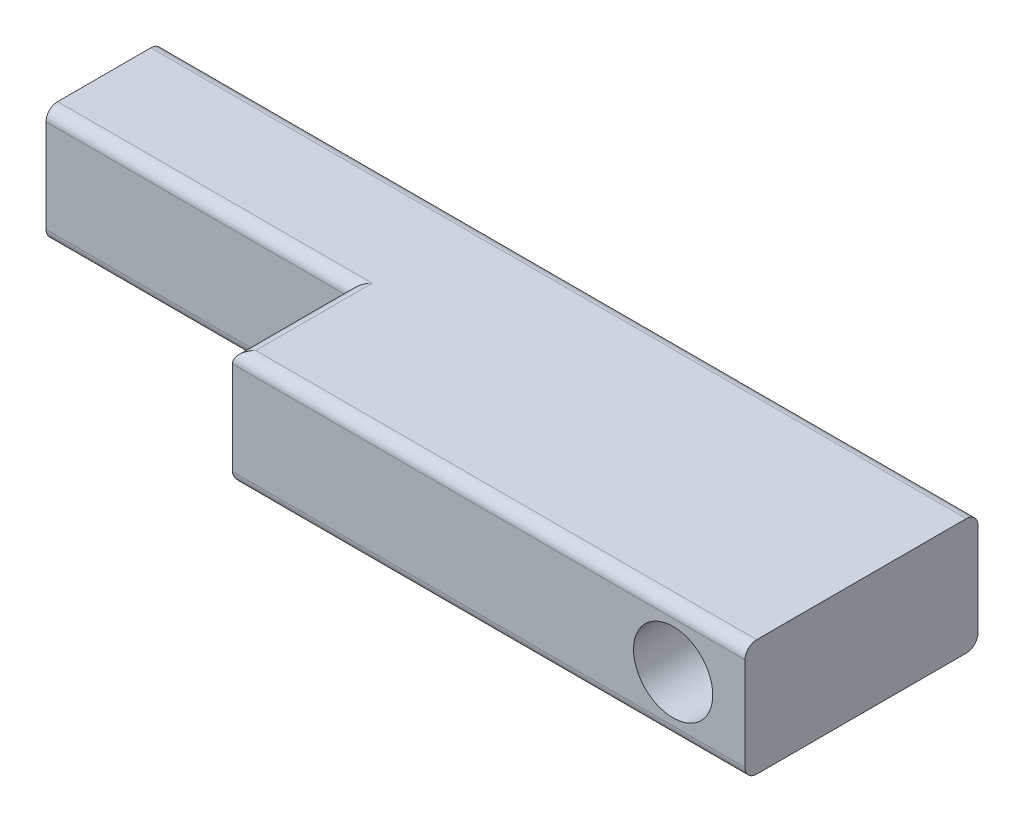
ISO-10303-21;
HEADER;
FILE_DESCRIPTION(('STEP AP214'),'2;1');
FILE_NAME('part.step','',(''),(''),'','','');
FILE_SCHEMA(('AUTOMOTIVE_DESIGN { 1 0 10303 214 1 1 1 1 }'));
ENDSEC;
DATA;
#1=APPLICATION_CONTEXT('core data for automotive mechanical design processes');
#2=APPLICATION_PROTOCOL_DEFINITION('international standard','automotive_design',2000,#1);
#3=PRODUCT_CONTEXT('',#1,'mechanical');
#4=PRODUCT('Part','Part','',(#3));
#5=PRODUCT_RELATED_PRODUCT_CATEGORY('part','',(#4));
#6=PRODUCT_DEFINITION_FORMATION('','',#4);
#7=PRODUCT_DEFINITION_CONTEXT('part definition',#1,'design');
#8=PRODUCT_DEFINITION('design','',#6,#7);
#9=PRODUCT_DEFINITION_SHAPE('','',#8);
#10=(LENGTH_UNIT() NAMED_UNIT(*) SI_UNIT(.MILLI.,.METRE.));
#11=(NAMED_UNIT(*) PLANE_ANGLE_UNIT() SI_UNIT($,.RADIAN.));
#12=(NAMED_UNIT(*) SI_UNIT($,.STERADIAN.) SOLID_ANGLE_UNIT());
#13=UNCERTAINTY_MEASURE_WITH_UNIT(LENGTH_MEASURE(1.E-05),#10,'distance_accuracy_value','');
#14=(GEOMETRIC_REPRESENTATION_CONTEXT(3) GLOBAL_UNCERTAINTY_ASSIGNED_CONTEXT((#13)) GLOBAL_UNIT_ASSIGNED_CONTEXT((#10,
#11,#12)) REPRESENTATION_CONTEXT('',''));
#15=CARTESIAN_POINT('',(0.,0.,0.));
#16=DIRECTION('',(0.,0.,1.));
#17=DIRECTION('',(1.,0.,0.));
#18=AXIS2_PLACEMENT_3D('',#15,#16,#17);
#19=CARTESIAN_POINT('',(0.,0.,5.));
#20=DIRECTION('',(0.,0.,-1.));
#21=DIRECTION('',(-1.,0.,0.));
#22=AXIS2_PLACEMENT_3D('',#19,#20,#21);
#23=PLANE('',#22);
#24=DIRECTION('',(0.,-1.,0.));
#25=VECTOR('',#24,1.);
#26=CARTESIAN_POINT('',(-17.5,-2.5,5.));
#27=LINE('',#26,#25);
#28=CARTESIAN_POINT('',(-17.5,2.,5.));
#29=VERTEX_POINT('',#28);
#30=CARTESIAN_POINT('',(-17.5,-2.,5.));
#31=VERTEX_POINT('',#30);
#32=EDGE_CURVE('E179',#29,#31,#27,.T.);
#33=ORIENTED_EDGE('',*,*,#32,.T.);
#34=DIRECTION('',(1.,0.,0.));
#35=VECTOR('',#34,1.);
#36=CARTESIAN_POINT('',(0.,-2.,5.));
#37=LINE('',#36,#35);
#38=CARTESIAN_POINT('',(-4.5,-2.,5.));
#39=VERTEX_POINT('',#38);
#40=EDGE_CURVE('E152',#31,#39,#37,.T.);
#41=ORIENTED_EDGE('',*,*,#40,.T.);
#42=DIRECTION('',(0.,-1.,0.));
#43=VECTOR('',#42,1.);
#44=CARTESIAN_POINT('',(-4.5,2.5,5.));
#45=LINE('',#44,#43);
#46=CARTESIAN_POINT('',(-4.5,2.,5.));
#47=VERTEX_POINT('',#46);
#48=EDGE_CURVE('E159',#47,#39,#45,.T.);
#49=ORIENTED_EDGE('',*,*,#48,.F.);
#50=DIRECTION('',(-1.,0.,0.));
#51=VECTOR('',#50,1.);
#52=CARTESIAN_POINT('',(0.,2.,5.));
#53=LINE('',#52,#51);
#54=EDGE_CURVE('E144',#47,#29,#53,.T.);
#55=ORIENTED_EDGE('',*,*,#54,.T.);
#56=EDGE_LOOP('',(#33,#41,#49,#55));
#57=FACE_BOUND('',#56,.T.);
#58=ADVANCED_FACE('F39',(#57),#23,.F.);
#59=CARTESIAN_POINT('',(17.5,-2.5,5.));
#60=DIRECTION('',(-1.,0.,0.));
#61=DIRECTION('',(0.,0.,1.));
#62=AXIS2_PLACEMENT_3D('',#59,#60,#61);
#63=PLANE('',#62);
#64=DIRECTION('',(0.,1.,0.));
#65=VECTOR('',#64,1.);
#66=CARTESIAN_POINT('',(17.5,2.5,10.));
#67=LINE('',#66,#65);
#68=CARTESIAN_POINT('',(17.5,-2.,10.));
#69=VERTEX_POINT('',#68);
#70=CARTESIAN_POINT('',(17.5,2.,10.));
#71=VERTEX_POINT('',#70);
#72=EDGE_CURVE('E170',#69,#71,#67,.T.);
#73=ORIENTED_EDGE('',*,*,#72,.F.);
#74=CARTESIAN_POINT('',(17.5,-2.,9.5));
#75=DIRECTION('',(-1.,0.,0.));
#76=DIRECTION('',(0.,0.,1.));
#77=AXIS2_PLACEMENT_3D('',#74,#75,#76);
#78=CIRCLE('',#77,0.5);
#79=CARTESIAN_POINT('',(17.5,-2.5,9.5));
#80=VERTEX_POINT('',#79);
#81=EDGE_CURVE('E257',#69,#80,#78,.F.);
#82=ORIENTED_EDGE('',*,*,#81,.T.);
#83=DIRECTION('',(0.,0.,-1.));
#84=VECTOR('',#83,1.);
#85=CARTESIAN_POINT('',(17.5,-2.5,5.));
#86=LINE('',#85,#84);
#87=CARTESIAN_POINT('',(17.5,-2.5,0.5));
#88=VERTEX_POINT('',#87);
#89=EDGE_CURVE('E182',#80,#88,#86,.T.);
#90=ORIENTED_EDGE('',*,*,#89,.T.);
#91=CARTESIAN_POINT('',(17.5,-2.,0.5));
#92=DIRECTION('',(-1.,0.,0.));
#93=DIRECTION('',(0.,0.,1.));
#94=AXIS2_PLACEMENT_3D('',#91,#92,#93);
#95=CIRCLE('',#94,0.5);
#96=CARTESIAN_POINT('',(17.5,-2.,0.));
#97=VERTEX_POINT('',#96);
#98=EDGE_CURVE('E63',#88,#97,#95,.F.);
#99=ORIENTED_EDGE('',*,*,#98,.T.);
#100=DIRECTION('',(0.,1.,0.));
#101=VECTOR('',#100,1.);
#102=CARTESIAN_POINT('',(17.5,-2.5,0.));
#103=LINE('',#102,#101);
#104=CARTESIAN_POINT('',(17.5,2.,0.));
#105=VERTEX_POINT('',#104);
#106=EDGE_CURVE('E184',#97,#105,#103,.T.);
#107=ORIENTED_EDGE('',*,*,#106,.T.);
#108=CARTESIAN_POINT('',(17.5,2.,0.5));
#109=DIRECTION('',(-1.,0.,0.));
#110=DIRECTION('',(0.,0.,1.));
#111=AXIS2_PLACEMENT_3D('',#108,#109,#110);
#112=CIRCLE('',#111,0.5);
#113=CARTESIAN_POINT('',(17.5,2.5,0.5));
#114=VERTEX_POINT('',#113);
#115=EDGE_CURVE('E249',#105,#114,#112,.F.);
#116=ORIENTED_EDGE('',*,*,#115,.T.);
#117=DIRECTION('',(0.,0.,-1.));
#118=VECTOR('',#117,1.);
#119=CARTESIAN_POINT('',(17.5,2.5,5.));
#120=LINE('',#119,#118);
#121=CARTESIAN_POINT('',(17.5,2.5,9.5));
#122=VERTEX_POINT('',#121);
#123=EDGE_CURVE('E200',#122,#114,#120,.T.);
#124=ORIENTED_EDGE('',*,*,#123,.F.);
#125=CARTESIAN_POINT('',(17.5,2.,9.5));
#126=DIRECTION('',(-1.,0.,0.));
#127=DIRECTION('',(0.,0.,1.));
#128=AXIS2_PLACEMENT_3D('',#125,#126,#127);
#129=CIRCLE('',#128,0.5);
#130=EDGE_CURVE('E254',#122,#71,#129,.F.);
#131=ORIENTED_EDGE('',*,*,#130,.T.);
#132=EDGE_LOOP('',(#73,#82,#90,#99,#107,#116,#124,#131));
#133=FACE_BOUND('',#132,.T.);
#134=ADVANCED_FACE('F308',(#133),#63,.F.);
#135=CARTESIAN_POINT('',(-17.5,2.5,5.));
#136=DIRECTION('',(0.,-1.,0.));
#137=DIRECTION('',(0.,0.,-1.));
#138=AXIS2_PLACEMENT_3D('',#135,#136,#137);
#139=PLANE('',#138);
#140=DIRECTION('',(0.,0.,-1.));
#141=VECTOR('',#140,1.);
#142=CARTESIAN_POINT('',(-17.5,2.5,5.));
#143=LINE('',#142,#141);
#144=CARTESIAN_POINT('',(-17.5,2.5,4.5));
#145=VERTEX_POINT('',#144);
#146=CARTESIAN_POINT('',(-17.5,2.5,0.5));
#147=VERTEX_POINT('',#146);
#148=EDGE_CURVE('E196',#145,#147,#143,.T.);
#149=ORIENTED_EDGE('',*,*,#148,.F.);
#150=DIRECTION('',(-1.,0.,0.));
#151=VECTOR('',#150,1.);
#152=CARTESIAN_POINT('',(-17.5,2.5,4.5));
#153=LINE('',#152,#151);
#154=CARTESIAN_POINT('',(-4.,2.5,4.5));
#155=VERTEX_POINT('',#154);
#156=EDGE_CURVE('E214',#145,#155,#153,.F.);
#157=ORIENTED_EDGE('',*,*,#156,.T.);
#158=DIRECTION('',(0.,0.,-1.));
#159=VECTOR('',#158,1.);
#160=CARTESIAN_POINT('',(-4.,2.5,5.));
#161=LINE('',#160,#159);
#162=CARTESIAN_POINT('',(-4.,2.5,9.5));
#163=VERTEX_POINT('',#162);
#164=EDGE_CURVE('E137',#155,#163,#161,.F.);
#165=ORIENTED_EDGE('',*,*,#164,.T.);
#166=DIRECTION('',(-1.,0.,0.));
#167=VECTOR('',#166,1.);
#168=CARTESIAN_POINT('',(-17.5,2.5,9.5));
#169=LINE('',#168,#167);
#170=EDGE_CURVE('E209',#163,#122,#169,.F.);
#171=ORIENTED_EDGE('',*,*,#170,.T.);
#172=ORIENTED_EDGE('',*,*,#123,.T.);
#173=DIRECTION('',(-1.,0.,0.));
#174=VECTOR('',#173,1.);
#175=CARTESIAN_POINT('',(-17.5,2.5,0.5));
#176=LINE('',#175,#174);
#177=EDGE_CURVE('E165',#114,#147,#176,.T.);
#178=ORIENTED_EDGE('',*,*,#177,.T.);
#179=EDGE_LOOP('',(#149,#157,#165,#171,#172,#178));
#180=FACE_BOUND('',#179,.T.);
#181=ADVANCED_FACE('F303',(#180),#139,.F.);
#182=CARTESIAN_POINT('',(-17.5,-2.5,5.));
#183=DIRECTION('',(1.,0.,0.));
#184=DIRECTION('',(0.,0.,-1.));
#185=AXIS2_PLACEMENT_3D('',#182,#183,#184);
#186=PLANE('',#185);
#187=DIRECTION('',(0.,0.,-1.));
#188=VECTOR('',#187,1.);
#189=CARTESIAN_POINT('',(-17.5,-2.5,5.));
#190=LINE('',#189,#188);
#191=CARTESIAN_POINT('',(-17.5,-2.5,4.5));
#192=VERTEX_POINT('',#191);
#193=CARTESIAN_POINT('',(-17.5,-2.5,0.5));
#194=VERTEX_POINT('',#193);
#195=EDGE_CURVE('E192',#192,#194,#190,.T.);
#196=ORIENTED_EDGE('',*,*,#195,.F.);
#197=CARTESIAN_POINT('',(-17.5,-2.,4.5));
#198=DIRECTION('',(1.,0.,0.));
#199=DIRECTION('',(0.,0.,-1.));
#200=AXIS2_PLACEMENT_3D('',#197,#198,#199);
#201=CIRCLE('',#200,0.5);
#202=EDGE_CURVE('E240',#192,#31,#201,.F.);
#203=ORIENTED_EDGE('',*,*,#202,.T.);
#204=ORIENTED_EDGE('',*,*,#32,.F.);
#205=CARTESIAN_POINT('',(-17.5,2.,4.5));
#206=DIRECTION('',(1.,0.,0.));
#207=DIRECTION('',(0.,0.,-1.));
#208=AXIS2_PLACEMENT_3D('',#205,#206,#207);
#209=CIRCLE('',#208,0.5);
#210=EDGE_CURVE('E146',#29,#145,#209,.F.);
#211=ORIENTED_EDGE('',*,*,#210,.T.);
#212=ORIENTED_EDGE('',*,*,#148,.T.);
#213=CARTESIAN_POINT('',(-17.5,2.,0.5));
#214=DIRECTION('',(1.,0.,0.));
#215=DIRECTION('',(0.,0.,-1.));
#216=AXIS2_PLACEMENT_3D('',#213,#214,#215);
#217=CIRCLE('',#216,0.5);
#218=CARTESIAN_POINT('',(-17.5,2.,0.));
#219=VERTEX_POINT('',#218);
#220=EDGE_CURVE('E232',#147,#219,#217,.F.);
#221=ORIENTED_EDGE('',*,*,#220,.T.);
#222=DIRECTION('',(0.,-1.,0.));
#223=VECTOR('',#222,1.);
#224=CARTESIAN_POINT('',(-17.5,-2.5,0.));
#225=LINE('',#224,#223);
#226=CARTESIAN_POINT('',(-17.5,-2.,0.));
#227=VERTEX_POINT('',#226);
#228=EDGE_CURVE('E183',#219,#227,#225,.T.);
#229=ORIENTED_EDGE('',*,*,#228,.T.);
#230=CARTESIAN_POINT('',(-17.5,-2.,0.5));
#231=DIRECTION('',(1.,0.,0.));
#232=DIRECTION('',(0.,0.,-1.));
#233=AXIS2_PLACEMENT_3D('',#230,#231,#232);
#234=CIRCLE('',#233,0.5);
#235=EDGE_CURVE('E235',#227,#194,#234,.F.);
#236=ORIENTED_EDGE('',*,*,#235,.T.);
#237=EDGE_LOOP('',(#196,#203,#204,#211,#212,#221,#229,#236));
#238=FACE_BOUND('',#237,.T.);
#239=ADVANCED_FACE('F295',(#238),#186,.F.);
#240=CARTESIAN_POINT('',(-17.5,-2.5,5.));
#241=DIRECTION('',(0.,1.,0.));
#242=DIRECTION('',(0.,0.,1.));
#243=AXIS2_PLACEMENT_3D('',#240,#241,#242);
#244=PLANE('',#243);
#245=DIRECTION('',(0.,0.,-1.));
#246=VECTOR('',#245,1.);
#247=CARTESIAN_POINT('',(-4.,-2.5,5.));
#248=LINE('',#247,#246);
#249=CARTESIAN_POINT('',(-4.,-2.5,9.5));
#250=VERTEX_POINT('',#249);
#251=CARTESIAN_POINT('',(-4.,-2.5,4.5));
#252=VERTEX_POINT('',#251);
#253=EDGE_CURVE('E224',#250,#252,#248,.T.);
#254=ORIENTED_EDGE('',*,*,#253,.T.);
#255=DIRECTION('',(1.,0.,0.));
#256=VECTOR('',#255,1.);
#257=CARTESIAN_POINT('',(-17.5,-2.5,4.5));
#258=LINE('',#257,#256);
#259=EDGE_CURVE('E153',#252,#192,#258,.F.);
#260=ORIENTED_EDGE('',*,*,#259,.T.);
#261=ORIENTED_EDGE('',*,*,#195,.T.);
#262=DIRECTION('',(1.,0.,0.));
#263=VECTOR('',#262,1.);
#264=CARTESIAN_POINT('',(17.5,-2.5,0.5));
#265=LINE('',#264,#263);
#266=EDGE_CURVE('E217',#194,#88,#265,.T.);
#267=ORIENTED_EDGE('',*,*,#266,.T.);
#268=ORIENTED_EDGE('',*,*,#89,.F.);
#269=DIRECTION('',(1.,0.,0.));
#270=VECTOR('',#269,1.);
#271=CARTESIAN_POINT('',(-17.5,-2.5,9.5));
#272=LINE('',#271,#270);
#273=EDGE_CURVE('E221',#80,#250,#272,.F.);
#274=ORIENTED_EDGE('',*,*,#273,.T.);
#275=EDGE_LOOP('',(#254,#260,#261,#267,#268,#274));
#276=FACE_BOUND('',#275,.T.);
#277=ADVANCED_FACE('F285',(#276),#244,.F.);
#278=CARTESIAN_POINT('',(0.,0.,0.));
#279=DIRECTION('',(0.,0.,-1.));
#280=DIRECTION('',(-1.,0.,0.));
#281=AXIS2_PLACEMENT_3D('',#278,#279,#280);
#282=PLANE('',#281);
#283=CARTESIAN_POINT('',(14.4153036237927,0.,0.));
#284=DIRECTION('',(0.,0.,-1.));
#285=DIRECTION('',(-1.,0.,0.));
#286=AXIS2_PLACEMENT_3D('',#283,#284,#285);
#287=CIRCLE('',#286,1.69999999999999);
#288=CARTESIAN_POINT('',(12.7153036237927,0.,0.));
#289=VERTEX_POINT('',#288);
#290=EDGE_CURVE('E272',#289,#289,#287,.T.);
#291=ORIENTED_EDGE('',*,*,#290,.F.);
#292=EDGE_LOOP('',(#291));
#293=FACE_BOUND('',#292,.T.);
#294=ORIENTED_EDGE('',*,*,#106,.F.);
#295=DIRECTION('',(1.,0.,0.));
#296=VECTOR('',#295,1.);
#297=CARTESIAN_POINT('',(-17.5,-2.,0.));
#298=LINE('',#297,#296);
#299=EDGE_CURVE('E11',#97,#227,#298,.F.);
#300=ORIENTED_EDGE('',*,*,#299,.T.);
#301=ORIENTED_EDGE('',*,*,#228,.F.);
#302=DIRECTION('',(-1.,0.,0.));
#303=VECTOR('',#302,1.);
#304=CARTESIAN_POINT('',(17.5,2.,0.));
#305=LINE('',#304,#303);
#306=EDGE_CURVE('E49',#219,#105,#305,.F.);
#307=ORIENTED_EDGE('',*,*,#306,.T.);
#308=EDGE_LOOP('',(#294,#300,#301,#307));
#309=FACE_BOUND('',#308,.T.);
#310=ADVANCED_FACE('F283',(#293,#309),#282,.T.);
#311=CARTESIAN_POINT('',(-4.5,2.5,10.));
#312=DIRECTION('',(1.,0.,0.));
#313=DIRECTION('',(0.,0.,-1.));
#314=AXIS2_PLACEMENT_3D('',#311,#312,#313);
#315=PLANE('',#314);
#316=DIRECTION('',(0.,-1.,0.));
#317=VECTOR('',#316,1.);
#318=CARTESIAN_POINT('',(-4.5,2.5,10.));
#319=LINE('',#318,#317);
#320=CARTESIAN_POINT('',(-4.5,2.,10.));
#321=VERTEX_POINT('',#320);
#322=CARTESIAN_POINT('',(-4.5,-2.,10.));
#323=VERTEX_POINT('',#322);
#324=EDGE_CURVE('E162',#321,#323,#319,.T.);
#325=ORIENTED_EDGE('',*,*,#324,.F.);
#326=DIRECTION('',(0.,0.,-1.));
#327=VECTOR('',#326,1.);
#328=CARTESIAN_POINT('',(-4.5,2.,10.));
#329=LINE('',#328,#327);
#330=EDGE_CURVE('E136',#321,#47,#329,.T.);
#331=ORIENTED_EDGE('',*,*,#330,.T.);
#332=ORIENTED_EDGE('',*,*,#48,.T.);
#333=DIRECTION('',(0.,0.,-1.));
#334=VECTOR('',#333,1.);
#335=CARTESIAN_POINT('',(-4.5,-2.,10.));
#336=LINE('',#335,#334);
#337=EDGE_CURVE('E166',#39,#323,#336,.F.);
#338=ORIENTED_EDGE('',*,*,#337,.T.);
#339=EDGE_LOOP('',(#325,#331,#332,#338));
#340=FACE_BOUND('',#339,.T.);
#341=ADVANCED_FACE('F158',(#340),#315,.F.);
#342=CARTESIAN_POINT('',(0.,0.,10.));
#343=DIRECTION('',(0.,0.,-1.));
#344=DIRECTION('',(-1.,0.,0.));
#345=AXIS2_PLACEMENT_3D('',#342,#343,#344);
#346=PLANE('',#345);
#347=CARTESIAN_POINT('',(14.4153036237927,0.,10.));
#348=DIRECTION('',(0.,0.,-1.));
#349=DIRECTION('',(-1.,0.,0.));
#350=AXIS2_PLACEMENT_3D('',#347,#348,#349);
#351=CIRCLE('',#350,1.7);
#352=CARTESIAN_POINT('',(12.7153036237927,0.,10.));
#353=VERTEX_POINT('',#352);
#354=EDGE_CURVE('E263',#353,#353,#351,.T.);
#355=ORIENTED_EDGE('',*,*,#354,.T.);
#356=EDGE_LOOP('',(#355));
#357=FACE_BOUND('',#356,.T.);
#358=ORIENTED_EDGE('',*,*,#324,.T.);
#359=DIRECTION('',(1.,0.,0.));
#360=VECTOR('',#359,1.);
#361=CARTESIAN_POINT('',(0.,-2.,10.));
#362=LINE('',#361,#360);
#363=EDGE_CURVE('E246',#323,#69,#362,.T.);
#364=ORIENTED_EDGE('',*,*,#363,.T.);
#365=ORIENTED_EDGE('',*,*,#72,.T.);
#366=DIRECTION('',(-1.,0.,0.));
#367=VECTOR('',#366,1.);
#368=CARTESIAN_POINT('',(0.,2.,10.));
#369=LINE('',#368,#367);
#370=EDGE_CURVE('E243',#71,#321,#369,.T.);
#371=ORIENTED_EDGE('',*,*,#370,.T.);
#372=EDGE_LOOP('',(#358,#364,#365,#371));
#373=FACE_BOUND('',#372,.T.);
#374=ADVANCED_FACE('F315',(#357,#373),#346,.F.);
#375=CARTESIAN_POINT('',(0.,2.,9.5));
#376=DIRECTION('',(-1.,0.,0.));
#377=DIRECTION('',(0.,0.,1.));
#378=AXIS2_PLACEMENT_3D('',#375,#376,#377);
#379=CYLINDRICAL_SURFACE('',#378,0.5);
#380=ORIENTED_EDGE('',*,*,#130,.F.);
#381=ORIENTED_EDGE('',*,*,#170,.F.);
#382=CARTESIAN_POINT('',(-4.,2.,9.5));
#383=DIRECTION('',(-0.707106781186547,0.,-0.707106781186547));
#384=DIRECTION('',(-0.707106781186547,0.,0.707106781186547));
#385=AXIS2_PLACEMENT_3D('',#382,#383,#384);
#386=ELLIPSE('',#385,0.707106781186547,0.5);
#387=EDGE_CURVE('E141',#321,#163,#386,.T.);
#388=ORIENTED_EDGE('',*,*,#387,.F.);
#389=ORIENTED_EDGE('',*,*,#370,.F.);
#390=EDGE_LOOP('',(#380,#381,#388,#389));
#391=FACE_BOUND('',#390,.T.);
#392=ADVANCED_FACE('F313',(#391),#379,.T.);
#393=CARTESIAN_POINT('',(0.,2.,4.5));
#394=DIRECTION('',(-1.,0.,0.));
#395=DIRECTION('',(0.,0.,1.));
#396=AXIS2_PLACEMENT_3D('',#393,#394,#395);
#397=CYLINDRICAL_SURFACE('',#396,0.5);
#398=ORIENTED_EDGE('',*,*,#210,.F.);
#399=ORIENTED_EDGE('',*,*,#54,.F.);
#400=CARTESIAN_POINT('',(-4.,2.,4.5));
#401=DIRECTION('',(-0.707106781186547,0.,-0.707106781186547));
#402=DIRECTION('',(0.707106781186547,0.,-0.707106781186547));
#403=AXIS2_PLACEMENT_3D('',#400,#401,#402);
#404=ELLIPSE('',#403,0.707106781186547,0.5);
#405=EDGE_CURVE('E131',#155,#47,#404,.F.);
#406=ORIENTED_EDGE('',*,*,#405,.F.);
#407=ORIENTED_EDGE('',*,*,#156,.F.);
#408=EDGE_LOOP('',(#398,#399,#406,#407));
#409=FACE_BOUND('',#408,.T.);
#410=ADVANCED_FACE('F145',(#409),#397,.T.);
#411=CARTESIAN_POINT('',(-4.,2.,10.));
#412=DIRECTION('',(0.,0.,-1.));
#413=DIRECTION('',(-1.,0.,0.));
#414=AXIS2_PLACEMENT_3D('',#411,#412,#413);
#415=CYLINDRICAL_SURFACE('',#414,0.5);
#416=ORIENTED_EDGE('',*,*,#387,.T.);
#417=ORIENTED_EDGE('',*,*,#164,.F.);
#418=ORIENTED_EDGE('',*,*,#405,.T.);
#419=ORIENTED_EDGE('',*,*,#330,.F.);
#420=EDGE_LOOP('',(#416,#417,#418,#419));
#421=FACE_BOUND('',#420,.T.);
#422=ADVANCED_FACE('F134',(#421),#415,.T.);
#423=CARTESIAN_POINT('',(0.,-2.,9.5));
#424=DIRECTION('',(1.,0.,0.));
#425=DIRECTION('',(0.,0.,-1.));
#426=AXIS2_PLACEMENT_3D('',#423,#424,#425);
#427=CYLINDRICAL_SURFACE('',#426,0.5);
#428=ORIENTED_EDGE('',*,*,#81,.F.);
#429=ORIENTED_EDGE('',*,*,#363,.F.);
#430=CARTESIAN_POINT('',(-4.,-2.,9.5));
#431=DIRECTION('',(0.707106781186547,0.,0.707106781186547));
#432=DIRECTION('',(0.707106781186547,0.,-0.707106781186547));
#433=AXIS2_PLACEMENT_3D('',#430,#431,#432);
#434=ELLIPSE('',#433,0.707106781186547,0.5);
#435=EDGE_CURVE('E43',#250,#323,#434,.F.);
#436=ORIENTED_EDGE('',*,*,#435,.F.);
#437=ORIENTED_EDGE('',*,*,#273,.F.);
#438=EDGE_LOOP('',(#428,#429,#436,#437));
#439=FACE_BOUND('',#438,.T.);
#440=ADVANCED_FACE('F320',(#439),#427,.T.);
#441=CARTESIAN_POINT('',(0.,-2.,4.5));
#442=DIRECTION('',(1.,0.,0.));
#443=DIRECTION('',(0.,0.,-1.));
#444=AXIS2_PLACEMENT_3D('',#441,#442,#443);
#445=CYLINDRICAL_SURFACE('',#444,0.5);
#446=ORIENTED_EDGE('',*,*,#202,.F.);
#447=ORIENTED_EDGE('',*,*,#259,.F.);
#448=CARTESIAN_POINT('',(-4.,-2.,4.5));
#449=DIRECTION('',(-0.707106781186547,0.,-0.707106781186547));
#450=DIRECTION('',(0.707106781186547,0.,-0.707106781186547));
#451=AXIS2_PLACEMENT_3D('',#448,#449,#450);
#452=ELLIPSE('',#451,0.707106781186547,0.5);
#453=EDGE_CURVE('E261',#39,#252,#452,.F.);
#454=ORIENTED_EDGE('',*,*,#453,.F.);
#455=ORIENTED_EDGE('',*,*,#40,.F.);
#456=EDGE_LOOP('',(#446,#447,#454,#455));
#457=FACE_BOUND('',#456,.T.);
#458=ADVANCED_FACE('F300',(#457),#445,.T.);
#459=CARTESIAN_POINT('',(-4.,-2.,5.));
#460=DIRECTION('',(0.,0.,-1.));
#461=DIRECTION('',(-1.,0.,0.));
#462=AXIS2_PLACEMENT_3D('',#459,#460,#461);
#463=CYLINDRICAL_SURFACE('',#462,0.5);
#464=ORIENTED_EDGE('',*,*,#435,.T.);
#465=ORIENTED_EDGE('',*,*,#337,.F.);
#466=ORIENTED_EDGE('',*,*,#453,.T.);
#467=ORIENTED_EDGE('',*,*,#253,.F.);
#468=EDGE_LOOP('',(#464,#465,#466,#467));
#469=FACE_BOUND('',#468,.T.);
#470=ADVANCED_FACE('F322',(#469),#463,.T.);
#471=CARTESIAN_POINT('',(-17.5,-2.,0.5));
#472=DIRECTION('',(-1.,0.,0.));
#473=DIRECTION('',(0.,0.,1.));
#474=AXIS2_PLACEMENT_3D('',#471,#472,#473);
#475=CYLINDRICAL_SURFACE('',#474,0.5);
#476=ORIENTED_EDGE('',*,*,#235,.F.);
#477=ORIENTED_EDGE('',*,*,#299,.F.);
#478=ORIENTED_EDGE('',*,*,#98,.F.);
#479=ORIENTED_EDGE('',*,*,#266,.F.);
#480=EDGE_LOOP('',(#476,#477,#478,#479));
#481=FACE_BOUND('',#480,.T.);
#482=ADVANCED_FACE('F291',(#481),#475,.T.);
#483=CARTESIAN_POINT('',(-17.5,2.,0.5));
#484=DIRECTION('',(1.,0.,0.));
#485=DIRECTION('',(0.,0.,-1.));
#486=AXIS2_PLACEMENT_3D('',#483,#484,#485);
#487=CYLINDRICAL_SURFACE('',#486,0.5);
#488=ORIENTED_EDGE('',*,*,#115,.F.);
#489=ORIENTED_EDGE('',*,*,#306,.F.);
#490=ORIENTED_EDGE('',*,*,#220,.F.);
#491=ORIENTED_EDGE('',*,*,#177,.F.);
#492=EDGE_LOOP('',(#488,#489,#490,#491));
#493=FACE_BOUND('',#492,.T.);
#494=ADVANCED_FACE('F41',(#493),#487,.T.);
#495=CARTESIAN_POINT('',(14.4153036237927,0.,0.));
#496=DIRECTION('',(0.,0.,-1.));
#497=DIRECTION('',(-1.,0.,0.));
#498=AXIS2_PLACEMENT_3D('',#495,#496,#497);
#499=CYLINDRICAL_SURFACE('',#498,1.69999999999999);
#500=ORIENTED_EDGE('',*,*,#354,.F.);
#501=EDGE_LOOP('',(#500));
#502=FACE_BOUND('',#501,.T.);
#503=ORIENTED_EDGE('',*,*,#290,.T.);
#504=EDGE_LOOP('',(#503));
#505=FACE_BOUND('',#504,.T.);
#506=ADVANCED_FACE('F281',(#502,#505),#499,.F.);
#507=CLOSED_SHELL('',(#58,#134,#181,#239,#277,#310,#341,#374,#392,#410,#422,#440,#458,#470,#482,
#494,#506));
#508=MANIFOLD_SOLID_BREP('B2',#507);
#509=ADVANCED_BREP_SHAPE_REPRESENTATION('',(#18,#508),#14);
#510=SHAPE_DEFINITION_REPRESENTATION(#9,#509);
ENDSEC;
END-ISO-10303-21;
